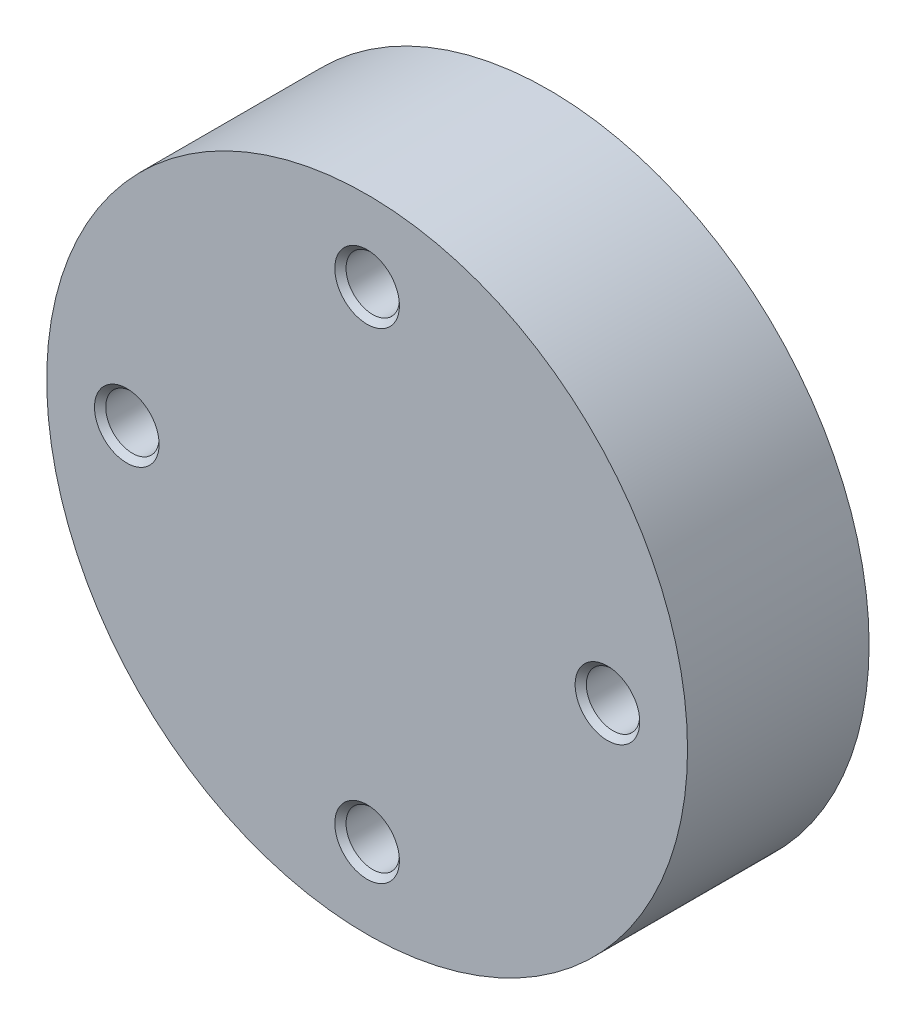
ISO-10303-21;
HEADER;
FILE_DESCRIPTION(('STEP AP214'),'2;1');
FILE_NAME('part.step','',(''),(''),'','','');
FILE_SCHEMA(('AUTOMOTIVE_DESIGN { 1 0 10303 214 1 1 1 1 }'));
ENDSEC;
DATA;
#1=APPLICATION_CONTEXT('core data for automotive mechanical design processes');
#2=APPLICATION_PROTOCOL_DEFINITION('international standard','automotive_design',2000,#1);
#3=PRODUCT_CONTEXT('',#1,'mechanical');
#4=PRODUCT('Part','Part','',(#3));
#5=PRODUCT_RELATED_PRODUCT_CATEGORY('part','',(#4));
#6=PRODUCT_DEFINITION_FORMATION('','',#4);
#7=PRODUCT_DEFINITION_CONTEXT('part definition',#1,'design');
#8=PRODUCT_DEFINITION('design','',#6,#7);
#9=PRODUCT_DEFINITION_SHAPE('','',#8);
#10=(LENGTH_UNIT() NAMED_UNIT(*) SI_UNIT(.MILLI.,.METRE.));
#11=(NAMED_UNIT(*) PLANE_ANGLE_UNIT() SI_UNIT($,.RADIAN.));
#12=(NAMED_UNIT(*) SI_UNIT($,.STERADIAN.) SOLID_ANGLE_UNIT());
#13=UNCERTAINTY_MEASURE_WITH_UNIT(LENGTH_MEASURE(1.E-05),#10,'distance_accuracy_value','');
#14=(GEOMETRIC_REPRESENTATION_CONTEXT(3) GLOBAL_UNCERTAINTY_ASSIGNED_CONTEXT((#13)) GLOBAL_UNIT_ASSIGNED_CONTEXT((#10,
#11,#12)) REPRESENTATION_CONTEXT('',''));
#15=CARTESIAN_POINT('',(0.,0.,0.));
#16=DIRECTION('',(0.,0.,1.));
#17=DIRECTION('',(1.,0.,0.));
#18=AXIS2_PLACEMENT_3D('',#15,#16,#17);
#19=CARTESIAN_POINT('',(0.,0.,17.));
#20=DIRECTION('',(0.,0.,-1.));
#21=DIRECTION('',(-1.,0.,0.));
#22=AXIS2_PLACEMENT_3D('',#19,#20,#21);
#23=CYLINDRICAL_SURFACE('',#22,30.);
#24=CARTESIAN_POINT('',(0.,0.,17.));
#25=DIRECTION('',(0.,0.,1.));
#26=DIRECTION('',(1.,0.,0.));
#27=AXIS2_PLACEMENT_3D('',#24,#25,#26);
#28=CIRCLE('',#27,30.);
#29=CARTESIAN_POINT('',(30.,0.,17.));
#30=VERTEX_POINT('',#29);
#31=EDGE_CURVE('E11',#30,#30,#28,.T.);
#32=ORIENTED_EDGE('',*,*,#31,.F.);
#33=EDGE_LOOP('',(#32));
#34=FACE_BOUND('',#33,.T.);
#35=CARTESIAN_POINT('',(0.,0.,0.));
#36=DIRECTION('',(0.,0.,1.));
#37=DIRECTION('',(1.,0.,0.));
#38=AXIS2_PLACEMENT_3D('',#35,#36,#37);
#39=CIRCLE('',#38,30.);
#40=CARTESIAN_POINT('',(30.,0.,0.));
#41=VERTEX_POINT('',#40);
#42=EDGE_CURVE('E43',#41,#41,#39,.T.);
#43=ORIENTED_EDGE('',*,*,#42,.T.);
#44=EDGE_LOOP('',(#43));
#45=FACE_BOUND('',#44,.T.);
#46=ADVANCED_FACE('F40',(#34,#45),#23,.T.);
#47=CARTESIAN_POINT('',(0.,0.,17.));
#48=DIRECTION('',(0.,0.,1.));
#49=DIRECTION('',(1.,0.,0.));
#50=AXIS2_PLACEMENT_3D('',#47,#48,#49);
#51=PLANE('',#50);
#52=CARTESIAN_POINT('',(0.,-22.5,17.));
#53=DIRECTION('',(0.,0.,1.));
#54=DIRECTION('',(1.,0.,0.));
#55=AXIS2_PLACEMENT_3D('',#52,#53,#54);
#56=CIRCLE('',#55,3.025);
#57=CARTESIAN_POINT('',(3.025,-22.5,17.));
#58=VERTEX_POINT('',#57);
#59=EDGE_CURVE('E77',#58,#58,#56,.T.);
#60=ORIENTED_EDGE('',*,*,#59,.F.);
#61=EDGE_LOOP('',(#60));
#62=FACE_BOUND('',#61,.T.);
#63=CARTESIAN_POINT('',(22.5,0.,17.));
#64=DIRECTION('',(0.,0.,1.));
#65=DIRECTION('',(1.,0.,0.));
#66=AXIS2_PLACEMENT_3D('',#63,#64,#65);
#67=CIRCLE('',#66,3.025);
#68=CARTESIAN_POINT('',(25.525,0.,17.));
#69=VERTEX_POINT('',#68);
#70=EDGE_CURVE('E70',#69,#69,#67,.T.);
#71=ORIENTED_EDGE('',*,*,#70,.F.);
#72=EDGE_LOOP('',(#71));
#73=FACE_BOUND('',#72,.T.);
#74=CARTESIAN_POINT('',(0.,22.5,17.));
#75=DIRECTION('',(0.,0.,1.));
#76=DIRECTION('',(1.,0.,0.));
#77=AXIS2_PLACEMENT_3D('',#74,#75,#76);
#78=CIRCLE('',#77,3.025);
#79=CARTESIAN_POINT('',(3.025,22.5,17.));
#80=VERTEX_POINT('',#79);
#81=EDGE_CURVE('E86',#80,#80,#78,.T.);
#82=ORIENTED_EDGE('',*,*,#81,.F.);
#83=EDGE_LOOP('',(#82));
#84=FACE_BOUND('',#83,.T.);
#85=CARTESIAN_POINT('',(-22.5,0.,17.));
#86=DIRECTION('',(0.,0.,1.));
#87=DIRECTION('',(1.,0.,0.));
#88=AXIS2_PLACEMENT_3D('',#85,#86,#87);
#89=CIRCLE('',#88,3.025);
#90=CARTESIAN_POINT('',(-19.475,0.,17.));
#91=VERTEX_POINT('',#90);
#92=EDGE_CURVE('E95',#91,#91,#89,.T.);
#93=ORIENTED_EDGE('',*,*,#92,.F.);
#94=EDGE_LOOP('',(#93));
#95=FACE_BOUND('',#94,.T.);
#96=ORIENTED_EDGE('',*,*,#31,.T.);
#97=EDGE_LOOP('',(#96));
#98=FACE_BOUND('',#97,.T.);
#99=ADVANCED_FACE('F126',(#62,#73,#84,#95,#98),#51,.T.);
#100=CARTESIAN_POINT('',(0.,0.,0.));
#101=DIRECTION('',(0.,0.,1.));
#102=DIRECTION('',(1.,0.,0.));
#103=AXIS2_PLACEMENT_3D('',#100,#101,#102);
#104=PLANE('',#103);
#105=CARTESIAN_POINT('',(0.,0.,0.));
#106=DIRECTION('',(0.,0.,1.));
#107=DIRECTION('',(1.,0.,0.));
#108=AXIS2_PLACEMENT_3D('',#105,#106,#107);
#109=CIRCLE('',#108,15.);
#110=CARTESIAN_POINT('',(15.,0.,0.));
#111=VERTEX_POINT('',#110);
#112=EDGE_CURVE('E104',#111,#111,#109,.T.);
#113=ORIENTED_EDGE('',*,*,#112,.T.);
#114=EDGE_LOOP('',(#113));
#115=FACE_BOUND('',#114,.T.);
#116=ORIENTED_EDGE('',*,*,#42,.F.);
#117=EDGE_LOOP('',(#116));
#118=FACE_BOUND('',#117,.T.);
#119=ADVANCED_FACE('F111',(#115,#118),#104,.F.);
#120=CARTESIAN_POINT('',(0.,0.,15.));
#121=DIRECTION('',(0.,0.,-1.));
#122=DIRECTION('',(-1.,0.,0.));
#123=AXIS2_PLACEMENT_3D('',#120,#121,#122);
#124=CYLINDRICAL_SURFACE('',#123,15.);
#125=CARTESIAN_POINT('',(0.,0.,15.));
#126=DIRECTION('',(0.,0.,1.));
#127=DIRECTION('',(1.,0.,0.));
#128=AXIS2_PLACEMENT_3D('',#125,#126,#127);
#129=CIRCLE('',#128,15.);
#130=CARTESIAN_POINT('',(15.,0.,15.));
#131=VERTEX_POINT('',#130);
#132=EDGE_CURVE('E105',#131,#131,#129,.T.);
#133=ORIENTED_EDGE('',*,*,#132,.T.);
#134=EDGE_LOOP('',(#133));
#135=FACE_BOUND('',#134,.T.);
#136=ORIENTED_EDGE('',*,*,#112,.F.);
#137=EDGE_LOOP('',(#136));
#138=FACE_BOUND('',#137,.T.);
#139=ADVANCED_FACE('F114',(#135,#138),#124,.F.);
#140=CARTESIAN_POINT('',(0.,0.,15.));
#141=DIRECTION('',(0.,0.,1.));
#142=DIRECTION('',(1.,0.,0.));
#143=AXIS2_PLACEMENT_3D('',#140,#141,#142);
#144=PLANE('',#143);
#145=ORIENTED_EDGE('',*,*,#132,.F.);
#146=EDGE_LOOP('',(#145));
#147=FACE_BOUND('',#146,.T.);
#148=ADVANCED_FACE('F116',(#147),#144,.F.);
#149=CARTESIAN_POINT('',(-22.5,0.,8.00000000000001));
#150=DIRECTION('',(0.,0.,1.));
#151=DIRECTION('',(1.,0.,0.));
#152=AXIS2_PLACEMENT_3D('',#149,#150,#151);
#153=CONICAL_SURFACE('',#152,2.49999999999999,1.02974425867665);
#154=CARTESIAN_POINT('',(-22.5,0.,6.4978484524311));
#155=VERTEX_POINT('',#154);
#156=VERTEX_LOOP('',#155);
#157=FACE_BOUND('',#156,.T.);
#158=CARTESIAN_POINT('',(-22.5,0.,8.00000000000001));
#159=DIRECTION('',(0.,0.,1.));
#160=DIRECTION('',(1.,0.,0.));
#161=AXIS2_PLACEMENT_3D('',#158,#159,#160);
#162=CIRCLE('',#161,2.49999999999999);
#163=CARTESIAN_POINT('',(-20.,0.,8.00000000000001));
#164=VERTEX_POINT('',#163);
#165=EDGE_CURVE('E101',#164,#164,#162,.T.);
#166=ORIENTED_EDGE('',*,*,#165,.T.);
#167=EDGE_LOOP('',(#166));
#168=FACE_BOUND('',#167,.T.);
#169=ADVANCED_FACE('F123',(#157,#168),#153,.F.);
#170=CARTESIAN_POINT('',(-22.5,0.,17.));
#171=DIRECTION('',(0.,0.,1.));
#172=DIRECTION('',(1.,0.,0.));
#173=AXIS2_PLACEMENT_3D('',#170,#171,#172);
#174=CYLINDRICAL_SURFACE('',#173,2.49999999999999);
#175=ORIENTED_EDGE('',*,*,#165,.F.);
#176=EDGE_LOOP('',(#175));
#177=FACE_BOUND('',#176,.T.);
#178=CARTESIAN_POINT('',(-22.5,0.,16.475));
#179=DIRECTION('',(0.,0.,1.));
#180=DIRECTION('',(1.,0.,0.));
#181=AXIS2_PLACEMENT_3D('',#178,#179,#180);
#182=CIRCLE('',#181,2.5);
#183=CARTESIAN_POINT('',(-20.,0.,16.475));
#184=VERTEX_POINT('',#183);
#185=EDGE_CURVE('E98',#184,#184,#182,.T.);
#186=ORIENTED_EDGE('',*,*,#185,.T.);
#187=EDGE_LOOP('',(#186));
#188=FACE_BOUND('',#187,.T.);
#189=ADVANCED_FACE('F153',(#177,#188),#174,.F.);
#190=CARTESIAN_POINT('',(-22.5,0.,17.));
#191=DIRECTION('',(0.,0.,1.));
#192=DIRECTION('',(1.,0.,0.));
#193=AXIS2_PLACEMENT_3D('',#190,#191,#192);
#194=CONICAL_SURFACE('',#193,3.025,0.785398163397445);
#195=ORIENTED_EDGE('',*,*,#185,.F.);
#196=EDGE_LOOP('',(#195));
#197=FACE_BOUND('',#196,.T.);
#198=ORIENTED_EDGE('',*,*,#92,.T.);
#199=EDGE_LOOP('',(#198));
#200=FACE_BOUND('',#199,.T.);
#201=ADVANCED_FACE('F150',(#197,#200),#194,.F.);
#202=CARTESIAN_POINT('',(0.,22.5,8.00000000000001));
#203=DIRECTION('',(0.,0.,1.));
#204=DIRECTION('',(1.,0.,0.));
#205=AXIS2_PLACEMENT_3D('',#202,#203,#204);
#206=CONICAL_SURFACE('',#205,2.49999999999999,1.02974425867665);
#207=CARTESIAN_POINT('',(0.,22.5,6.4978484524311));
#208=VERTEX_POINT('',#207);
#209=VERTEX_LOOP('',#208);
#210=FACE_BOUND('',#209,.T.);
#211=CARTESIAN_POINT('',(0.,22.5,8.00000000000001));
#212=DIRECTION('',(0.,0.,1.));
#213=DIRECTION('',(1.,0.,0.));
#214=AXIS2_PLACEMENT_3D('',#211,#212,#213);
#215=CIRCLE('',#214,2.49999999999999);
#216=CARTESIAN_POINT('',(2.49999999999999,22.5,8.00000000000001));
#217=VERTEX_POINT('',#216);
#218=EDGE_CURVE('E92',#217,#217,#215,.T.);
#219=ORIENTED_EDGE('',*,*,#218,.T.);
#220=EDGE_LOOP('',(#219));
#221=FACE_BOUND('',#220,.T.);
#222=ADVANCED_FACE('F152',(#210,#221),#206,.F.);
#223=CARTESIAN_POINT('',(0.,22.5,17.));
#224=DIRECTION('',(0.,0.,1.));
#225=DIRECTION('',(1.,0.,0.));
#226=AXIS2_PLACEMENT_3D('',#223,#224,#225);
#227=CYLINDRICAL_SURFACE('',#226,2.49999999999999);
#228=ORIENTED_EDGE('',*,*,#218,.F.);
#229=EDGE_LOOP('',(#228));
#230=FACE_BOUND('',#229,.T.);
#231=CARTESIAN_POINT('',(0.,22.5,16.475));
#232=DIRECTION('',(0.,0.,1.));
#233=DIRECTION('',(1.,0.,0.));
#234=AXIS2_PLACEMENT_3D('',#231,#232,#233);
#235=CIRCLE('',#234,2.5);
#236=CARTESIAN_POINT('',(2.5,22.5,16.475));
#237=VERTEX_POINT('',#236);
#238=EDGE_CURVE('E89',#237,#237,#235,.T.);
#239=ORIENTED_EDGE('',*,*,#238,.T.);
#240=EDGE_LOOP('',(#239));
#241=FACE_BOUND('',#240,.T.);
#242=ADVANCED_FACE('F160',(#230,#241),#227,.F.);
#243=CARTESIAN_POINT('',(0.,22.5,17.));
#244=DIRECTION('',(0.,0.,1.));
#245=DIRECTION('',(1.,0.,0.));
#246=AXIS2_PLACEMENT_3D('',#243,#244,#245);
#247=CONICAL_SURFACE('',#246,3.025,0.785398163397445);
#248=ORIENTED_EDGE('',*,*,#238,.F.);
#249=EDGE_LOOP('',(#248));
#250=FACE_BOUND('',#249,.T.);
#251=ORIENTED_EDGE('',*,*,#81,.T.);
#252=EDGE_LOOP('',(#251));
#253=FACE_BOUND('',#252,.T.);
#254=ADVANCED_FACE('F190',(#250,#253),#247,.F.);
#255=CARTESIAN_POINT('',(22.5,0.,8.00000000000001));
#256=DIRECTION('',(0.,0.,1.));
#257=DIRECTION('',(1.,0.,0.));
#258=AXIS2_PLACEMENT_3D('',#255,#256,#257);
#259=CONICAL_SURFACE('',#258,2.49999999999999,1.02974425867665);
#260=CARTESIAN_POINT('',(22.5,0.,6.4978484524311));
#261=VERTEX_POINT('',#260);
#262=VERTEX_LOOP('',#261);
#263=FACE_BOUND('',#262,.T.);
#264=CARTESIAN_POINT('',(22.5,0.,8.00000000000001));
#265=DIRECTION('',(0.,0.,1.));
#266=DIRECTION('',(1.,0.,0.));
#267=AXIS2_PLACEMENT_3D('',#264,#265,#266);
#268=CIRCLE('',#267,2.49999999999999);
#269=CARTESIAN_POINT('',(25.,0.,8.00000000000001));
#270=VERTEX_POINT('',#269);
#271=EDGE_CURVE('E83',#270,#270,#268,.T.);
#272=ORIENTED_EDGE('',*,*,#271,.T.);
#273=EDGE_LOOP('',(#272));
#274=FACE_BOUND('',#273,.T.);
#275=ADVANCED_FACE('F203',(#263,#274),#259,.F.);
#276=CARTESIAN_POINT('',(22.5,0.,17.));
#277=DIRECTION('',(0.,0.,1.));
#278=DIRECTION('',(1.,0.,0.));
#279=AXIS2_PLACEMENT_3D('',#276,#277,#278);
#280=CYLINDRICAL_SURFACE('',#279,2.49999999999999);
#281=ORIENTED_EDGE('',*,*,#271,.F.);
#282=EDGE_LOOP('',(#281));
#283=FACE_BOUND('',#282,.T.);
#284=CARTESIAN_POINT('',(22.5,0.,16.475));
#285=DIRECTION('',(0.,0.,1.));
#286=DIRECTION('',(1.,0.,0.));
#287=AXIS2_PLACEMENT_3D('',#284,#285,#286);
#288=CIRCLE('',#287,2.5);
#289=CARTESIAN_POINT('',(25.,0.,16.475));
#290=VERTEX_POINT('',#289);
#291=EDGE_CURVE('E74',#290,#290,#288,.T.);
#292=ORIENTED_EDGE('',*,*,#291,.T.);
#293=EDGE_LOOP('',(#292));
#294=FACE_BOUND('',#293,.T.);
#295=ADVANCED_FACE('F198',(#283,#294),#280,.F.);
#296=CARTESIAN_POINT('',(22.5,0.,17.));
#297=DIRECTION('',(0.,0.,1.));
#298=DIRECTION('',(1.,0.,0.));
#299=AXIS2_PLACEMENT_3D('',#296,#297,#298);
#300=CONICAL_SURFACE('',#299,3.025,0.785398163397445);
#301=ORIENTED_EDGE('',*,*,#291,.F.);
#302=EDGE_LOOP('',(#301));
#303=FACE_BOUND('',#302,.T.);
#304=ORIENTED_EDGE('',*,*,#70,.T.);
#305=EDGE_LOOP('',(#304));
#306=FACE_BOUND('',#305,.T.);
#307=ADVANCED_FACE('F64',(#303,#306),#300,.F.);
#308=CARTESIAN_POINT('',(0.,-22.5,8.00000000000001));
#309=DIRECTION('',(0.,0.,1.));
#310=DIRECTION('',(1.,0.,0.));
#311=AXIS2_PLACEMENT_3D('',#308,#309,#310);
#312=CONICAL_SURFACE('',#311,2.49999999999999,1.02974425867665);
#313=CARTESIAN_POINT('',(0.,-22.5,6.4978484524311));
#314=VERTEX_POINT('',#313);
#315=VERTEX_LOOP('',#314);
#316=FACE_BOUND('',#315,.T.);
#317=CARTESIAN_POINT('',(0.,-22.5,8.00000000000001));
#318=DIRECTION('',(0.,0.,1.));
#319=DIRECTION('',(1.,0.,0.));
#320=AXIS2_PLACEMENT_3D('',#317,#318,#319);
#321=CIRCLE('',#320,2.49999999999999);
#322=CARTESIAN_POINT('',(2.49999999999999,-22.5,8.00000000000001));
#323=VERTEX_POINT('',#322);
#324=EDGE_CURVE('E68',#323,#323,#321,.T.);
#325=ORIENTED_EDGE('',*,*,#324,.T.);
#326=EDGE_LOOP('',(#325));
#327=FACE_BOUND('',#326,.T.);
#328=ADVANCED_FACE('F60',(#316,#327),#312,.F.);
#329=CARTESIAN_POINT('',(0.,-22.5,17.));
#330=DIRECTION('',(0.,0.,1.));
#331=DIRECTION('',(1.,0.,0.));
#332=AXIS2_PLACEMENT_3D('',#329,#330,#331);
#333=CYLINDRICAL_SURFACE('',#332,2.49999999999999);
#334=ORIENTED_EDGE('',*,*,#324,.F.);
#335=EDGE_LOOP('',(#334));
#336=FACE_BOUND('',#335,.T.);
#337=CARTESIAN_POINT('',(0.,-22.5,16.475));
#338=DIRECTION('',(0.,0.,1.));
#339=DIRECTION('',(1.,0.,0.));
#340=AXIS2_PLACEMENT_3D('',#337,#338,#339);
#341=CIRCLE('',#340,2.5);
#342=CARTESIAN_POINT('',(2.5,-22.5,16.475));
#343=VERTEX_POINT('',#342);
#344=EDGE_CURVE('E71',#343,#343,#341,.T.);
#345=ORIENTED_EDGE('',*,*,#344,.T.);
#346=EDGE_LOOP('',(#345));
#347=FACE_BOUND('',#346,.T.);
#348=ADVANCED_FACE('F63',(#336,#347),#333,.F.);
#349=CARTESIAN_POINT('',(0.,-22.5,17.));
#350=DIRECTION('',(0.,0.,1.));
#351=DIRECTION('',(1.,0.,0.));
#352=AXIS2_PLACEMENT_3D('',#349,#350,#351);
#353=CONICAL_SURFACE('',#352,3.025,0.785398163397445);
#354=ORIENTED_EDGE('',*,*,#344,.F.);
#355=EDGE_LOOP('',(#354));
#356=FACE_BOUND('',#355,.T.);
#357=ORIENTED_EDGE('',*,*,#59,.T.);
#358=EDGE_LOOP('',(#357));
#359=FACE_BOUND('',#358,.T.);
#360=ADVANCED_FACE('F216',(#356,#359),#353,.F.);
#361=CLOSED_SHELL('',(#46,#99,#119,#139,#148,#169,#189,#201,#222,#242,#254,#275,#295,#307,#328,
#348,#360));
#362=MANIFOLD_SOLID_BREP('B2',#361);
#363=ADVANCED_BREP_SHAPE_REPRESENTATION('',(#18,#362),#14);
#364=SHAPE_DEFINITION_REPRESENTATION(#9,#363);
ENDSEC;
END-ISO-10303-21;
